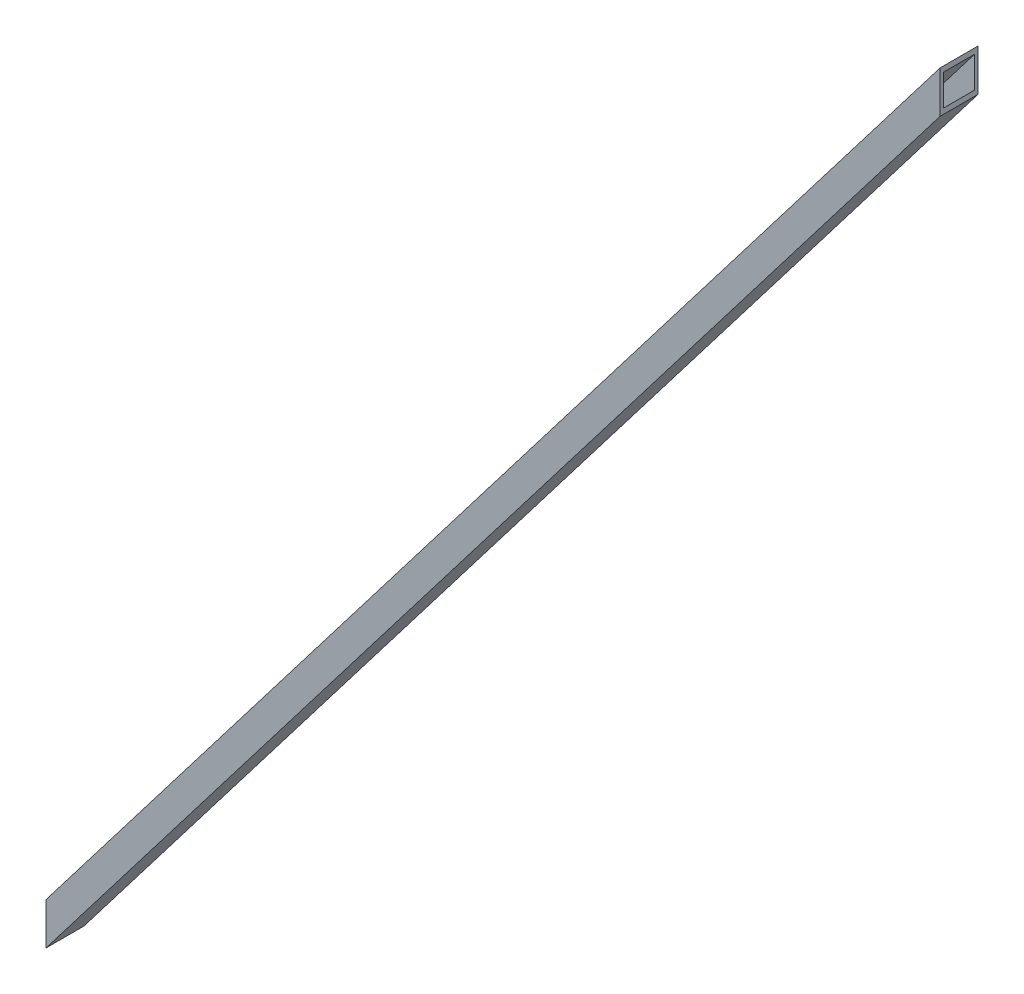
ISO-10303-21;
HEADER;
FILE_DESCRIPTION(('STEP AP214'),'2;1');
FILE_NAME('part.step','',(''),(''),'','','');
FILE_SCHEMA(('AUTOMOTIVE_DESIGN { 1 0 10303 214 1 1 1 1 }'));
ENDSEC;
DATA;
#1=APPLICATION_CONTEXT('core data for automotive mechanical design processes');
#2=APPLICATION_PROTOCOL_DEFINITION('international standard','automotive_design',2000,#1);
#3=PRODUCT_CONTEXT('',#1,'mechanical');
#4=PRODUCT('Part','Part','',(#3));
#5=PRODUCT_RELATED_PRODUCT_CATEGORY('part','',(#4));
#6=PRODUCT_DEFINITION_FORMATION('','',#4);
#7=PRODUCT_DEFINITION_CONTEXT('part definition',#1,'design');
#8=PRODUCT_DEFINITION('design','',#6,#7);
#9=PRODUCT_DEFINITION_SHAPE('','',#8);
#10=(LENGTH_UNIT() NAMED_UNIT(*) SI_UNIT(.MILLI.,.METRE.));
#11=(NAMED_UNIT(*) PLANE_ANGLE_UNIT() SI_UNIT($,.RADIAN.));
#12=(NAMED_UNIT(*) SI_UNIT($,.STERADIAN.) SOLID_ANGLE_UNIT());
#13=UNCERTAINTY_MEASURE_WITH_UNIT(LENGTH_MEASURE(1.E-05),#10,'distance_accuracy_value','');
#14=(GEOMETRIC_REPRESENTATION_CONTEXT(3) GLOBAL_UNCERTAINTY_ASSIGNED_CONTEXT((#13)) GLOBAL_UNIT_ASSIGNED_CONTEXT((#10,
#11,#12)) REPRESENTATION_CONTEXT('',''));
#15=CARTESIAN_POINT('',(0.,0.,0.));
#16=DIRECTION('',(0.,0.,1.));
#17=DIRECTION('',(1.,0.,0.));
#18=AXIS2_PLACEMENT_3D('',#15,#16,#17);
#19=CARTESIAN_POINT('',(-502.053424914183,28.9259895237384,-27.5));
#20=DIRECTION('',(-0.821369965673296,0.570395809495344,0.));
#21=DIRECTION('',(0.,0.,1.));
#22=AXIS2_PLACEMENT_3D('',#19,#20,#21);
#23=PLANE('',#22);
#24=DIRECTION('',(0.,0.,1.));
#25=VECTOR('',#24,1.);
#26=CARTESIAN_POINT('',(-500.,31.8829214001622,0.));
#27=LINE('',#26,#25);
#28=CARTESIAN_POINT('',(-500.,31.8829214001622,-30.2313000567496));
#29=VERTEX_POINT('',#28);
#30=CARTESIAN_POINT('',(-500.,31.8829214001622,0.231300056749522));
#31=VERTEX_POINT('',#30);
#32=EDGE_CURVE('E12',#29,#31,#27,.T.);
#33=ORIENTED_EDGE('',*,*,#32,.T.);
#34=DIRECTION('',(0.55323817471572,0.796662971590637,-0.243424796874917));
#35=VECTOR('',#34,1.);
#36=CARTESIAN_POINT('',(-498.197121324456,34.4790666929451,-0.561966560489669));
#37=LINE('',#36,#35);
#38=CARTESIAN_POINT('',(0.,751.882921400162,-219.768699943251));
#39=VERTEX_POINT('',#38);
#40=EDGE_CURVE('E96',#31,#39,#37,.T.);
#41=ORIENTED_EDGE('',*,*,#40,.T.);
#42=DIRECTION('',(0.,0.,1.));
#43=VECTOR('',#42,1.);
#44=CARTESIAN_POINT('',(0.,751.882921400162,0.));
#45=LINE('',#44,#43);
#46=CARTESIAN_POINT('',(0.,751.882921400162,-250.23130005675));
#47=VERTEX_POINT('',#46);
#48=EDGE_CURVE('E189',#47,#39,#45,.T.);
#49=ORIENTED_EDGE('',*,*,#48,.F.);
#50=DIRECTION('',(0.55323817471572,0.796662971590637,-0.243424796874917));
#51=VECTOR('',#50,1.);
#52=CARTESIAN_POINT('',(-513.318186471965,12.7047328805329,-24.371298009085));
#53=LINE('',#52,#51);
#54=EDGE_CURVE('E185',#29,#47,#53,.T.);
#55=ORIENTED_EDGE('',*,*,#54,.F.);
#56=EDGE_LOOP('',(#33,#41,#49,#55));
#57=FACE_BOUND('',#56,.T.);
#58=ADVANCED_FACE('F87',(#57),#23,.T.);
#59=CARTESIAN_POINT('',(-498.993153464335,27.5,-0.211712418943086));
#60=DIRECTION('',(0.402738614266017,0.,0.915315032422766));
#61=DIRECTION('',(0.,-1.,0.));
#62=AXIS2_PLACEMENT_3D('',#59,#60,#61);
#63=PLANE('',#62);
#64=DIRECTION('',(0.,-1.,0.));
#65=VECTOR('',#64,1.);
#66=CARTESIAN_POINT('',(-500.,0.,0.231300056749522));
#67=LINE('',#66,#65);
#68=CARTESIAN_POINT('',(-500.,-1.88292140016225,0.231300056749522));
#69=VERTEX_POINT('',#68);
#70=EDGE_CURVE('E184',#31,#69,#67,.T.);
#71=ORIENTED_EDGE('',*,*,#70,.T.);
#72=DIRECTION('',(0.55323817471572,0.796662971590637,-0.243424796874917));
#73=VECTOR('',#72,1.);
#74=CARTESIAN_POINT('',(-486.681813528035,17.2952671194671,-5.62870199091499));
#75=LINE('',#74,#73);
#76=CARTESIAN_POINT('',(0.,718.117078599838,-219.768699943251));
#77=VERTEX_POINT('',#76);
#78=EDGE_CURVE('E190',#69,#77,#75,.T.);
#79=ORIENTED_EDGE('',*,*,#78,.T.);
#80=DIRECTION('',(0.,-1.,0.));
#81=VECTOR('',#80,1.);
#82=CARTESIAN_POINT('',(0.,0.,-219.768699943251));
#83=LINE('',#82,#81);
#84=EDGE_CURVE('E204',#39,#77,#83,.T.);
#85=ORIENTED_EDGE('',*,*,#84,.F.);
#86=ORIENTED_EDGE('',*,*,#40,.F.);
#87=EDGE_LOOP('',(#71,#79,#85,#86));
#88=FACE_BOUND('',#87,.T.);
#89=ADVANCED_FACE('F218',(#88),#63,.T.);
#90=CARTESIAN_POINT('',(-497.946575085817,1.07401047626164,-2.5));
#91=DIRECTION('',(0.821369965673296,-0.570395809495344,0.));
#92=DIRECTION('',(0.,0.,-1.));
#93=AXIS2_PLACEMENT_3D('',#90,#91,#92);
#94=PLANE('',#93);
#95=DIRECTION('',(0.,0.,-1.));
#96=VECTOR('',#95,1.);
#97=CARTESIAN_POINT('',(-500.,-1.88292140016225,0.));
#98=LINE('',#97,#96);
#99=CARTESIAN_POINT('',(-500.,-1.88292140016225,-30.2313000567496));
#100=VERTEX_POINT('',#99);
#101=EDGE_CURVE('E193',#69,#100,#98,.T.);
#102=ORIENTED_EDGE('',*,*,#101,.T.);
#103=DIRECTION('',(0.55323817471572,0.796662971590637,-0.243424796874917));
#104=VECTOR('',#103,1.);
#105=CARTESIAN_POINT('',(-501.802878675544,-4.47906669294508,-29.4380334395104));
#106=LINE('',#105,#104);
#107=CARTESIAN_POINT('',(0.,718.117078599838,-250.23130005675));
#108=VERTEX_POINT('',#107);
#109=EDGE_CURVE('E194',#100,#108,#106,.T.);
#110=ORIENTED_EDGE('',*,*,#109,.T.);
#111=DIRECTION('',(0.,0.,-1.));
#112=VECTOR('',#111,1.);
#113=CARTESIAN_POINT('',(0.,718.117078599838,0.));
#114=LINE('',#113,#112);
#115=EDGE_CURVE('E206',#77,#108,#114,.T.);
#116=ORIENTED_EDGE('',*,*,#115,.F.);
#117=ORIENTED_EDGE('',*,*,#78,.F.);
#118=EDGE_LOOP('',(#102,#110,#116,#117));
#119=FACE_BOUND('',#118,.T.);
#120=ADVANCED_FACE('F221',(#119),#94,.T.);
#121=CARTESIAN_POINT('',(-501.006846535665,2.5,-29.7882875810569));
#122=DIRECTION('',(-0.402738614266017,0.,-0.915315032422766));
#123=DIRECTION('',(0.,1.,0.));
#124=AXIS2_PLACEMENT_3D('',#121,#122,#123);
#125=PLANE('',#124);
#126=DIRECTION('',(0.,1.,0.));
#127=VECTOR('',#126,1.);
#128=CARTESIAN_POINT('',(-500.,0.,-30.2313000567496));
#129=LINE('',#128,#127);
#130=EDGE_CURVE('E188',#100,#29,#129,.T.);
#131=ORIENTED_EDGE('',*,*,#130,.T.);
#132=ORIENTED_EDGE('',*,*,#54,.T.);
#133=DIRECTION('',(0.,1.,0.));
#134=VECTOR('',#133,1.);
#135=CARTESIAN_POINT('',(0.,0.,-250.23130005675));
#136=LINE('',#135,#134);
#137=EDGE_CURVE('E91',#108,#47,#136,.T.);
#138=ORIENTED_EDGE('',*,*,#137,.F.);
#139=ORIENTED_EDGE('',*,*,#109,.F.);
#140=EDGE_LOOP('',(#131,#132,#138,#139));
#141=FACE_BOUND('',#140,.T.);
#142=ADVANCED_FACE('F89',(#141),#125,.T.);
#143=CARTESIAN_POINT('',(-500.,0.,0.));
#144=DIRECTION('',(1.,0.,0.));
#145=DIRECTION('',(0.,0.,-1.));
#146=AXIS2_PLACEMENT_3D('',#143,#144,#145);
#147=PLANE('',#146);
#148=DIRECTION('',(0.,0.,-1.));
#149=VECTOR('',#148,1.);
#150=CARTESIAN_POINT('',(-500.,2.5,-15.));
#151=LINE('',#150,#149);
#152=CARTESIAN_POINT('',(-500.,2.5,-2.5));
#153=VERTEX_POINT('',#152);
#154=CARTESIAN_POINT('',(-500.,2.5,-27.5));
#155=VERTEX_POINT('',#154);
#156=EDGE_CURVE('E171',#153,#155,#151,.T.);
#157=ORIENTED_EDGE('',*,*,#156,.T.);
#158=DIRECTION('',(0.,1.,0.));
#159=VECTOR('',#158,1.);
#160=CARTESIAN_POINT('',(-500.,15.,-27.5));
#161=LINE('',#160,#159);
#162=CARTESIAN_POINT('',(-500.,27.5,-27.5));
#163=VERTEX_POINT('',#162);
#164=EDGE_CURVE('E163',#155,#163,#161,.T.);
#165=ORIENTED_EDGE('',*,*,#164,.T.);
#166=DIRECTION('',(0.,0.,1.));
#167=VECTOR('',#166,1.);
#168=CARTESIAN_POINT('',(-500.,27.5,-15.));
#169=LINE('',#168,#167);
#170=CARTESIAN_POINT('',(-500.,27.5,-2.5));
#171=VERTEX_POINT('',#170);
#172=EDGE_CURVE('E153',#163,#171,#169,.T.);
#173=ORIENTED_EDGE('',*,*,#172,.T.);
#174=DIRECTION('',(0.,-1.,0.));
#175=VECTOR('',#174,1.);
#176=CARTESIAN_POINT('',(-500.,15.,-2.5));
#177=LINE('',#176,#175);
#178=EDGE_CURVE('E336',#171,#153,#177,.T.);
#179=ORIENTED_EDGE('',*,*,#178,.T.);
#180=EDGE_LOOP('',(#157,#165,#173,#179));
#181=FACE_BOUND('',#180,.T.);
#182=ORIENTED_EDGE('',*,*,#130,.F.);
#183=ORIENTED_EDGE('',*,*,#101,.F.);
#184=ORIENTED_EDGE('',*,*,#70,.F.);
#185=ORIENTED_EDGE('',*,*,#32,.F.);
#186=EDGE_LOOP('',(#182,#183,#184,#185));
#187=FACE_BOUND('',#186,.T.);
#188=ADVANCED_FACE('F169',(#181,#187),#147,.F.);
#189=CARTESIAN_POINT('',(0.,0.,0.));
#190=DIRECTION('',(1.,0.,0.));
#191=DIRECTION('',(0.,0.,-1.));
#192=AXIS2_PLACEMENT_3D('',#189,#190,#191);
#193=PLANE('',#192);
#194=DIRECTION('',(0.,0.,1.));
#195=VECTOR('',#194,1.);
#196=CARTESIAN_POINT('',(0.,747.5,-235.));
#197=LINE('',#196,#195);
#198=CARTESIAN_POINT('',(0.,747.5,-247.5));
#199=VERTEX_POINT('',#198);
#200=CARTESIAN_POINT('',(0.,747.5,-222.5));
#201=VERTEX_POINT('',#200);
#202=EDGE_CURVE('E166',#199,#201,#197,.T.);
#203=ORIENTED_EDGE('',*,*,#202,.F.);
#204=DIRECTION('',(0.,1.,0.));
#205=VECTOR('',#204,1.);
#206=CARTESIAN_POINT('',(0.,735.,-247.5));
#207=LINE('',#206,#205);
#208=CARTESIAN_POINT('',(0.,722.5,-247.5));
#209=VERTEX_POINT('',#208);
#210=EDGE_CURVE('E165',#209,#199,#207,.T.);
#211=ORIENTED_EDGE('',*,*,#210,.F.);
#212=DIRECTION('',(0.,0.,-1.));
#213=VECTOR('',#212,1.);
#214=CARTESIAN_POINT('',(0.,722.5,-235.));
#215=LINE('',#214,#213);
#216=CARTESIAN_POINT('',(0.,722.5,-222.5));
#217=VERTEX_POINT('',#216);
#218=EDGE_CURVE('E179',#217,#209,#215,.T.);
#219=ORIENTED_EDGE('',*,*,#218,.F.);
#220=DIRECTION('',(0.,-1.,0.));
#221=VECTOR('',#220,1.);
#222=CARTESIAN_POINT('',(0.,735.,-222.5));
#223=LINE('',#222,#221);
#224=EDGE_CURVE('E177',#201,#217,#223,.T.);
#225=ORIENTED_EDGE('',*,*,#224,.F.);
#226=EDGE_LOOP('',(#203,#211,#219,#225));
#227=FACE_BOUND('',#226,.T.);
#228=ORIENTED_EDGE('',*,*,#48,.T.);
#229=ORIENTED_EDGE('',*,*,#84,.T.);
#230=ORIENTED_EDGE('',*,*,#115,.T.);
#231=ORIENTED_EDGE('',*,*,#137,.T.);
#232=EDGE_LOOP('',(#228,#229,#230,#231));
#233=FACE_BOUND('',#232,.T.);
#234=ADVANCED_FACE('F210',(#227,#233),#193,.T.);
#235=CARTESIAN_POINT('',(-500.,27.5,-27.5));
#236=DIRECTION('',(-0.821369965673296,0.570395809495344,0.));
#237=DIRECTION('',(0.,0.,1.));
#238=AXIS2_PLACEMENT_3D('',#235,#236,#237);
#239=PLANE('',#238);
#240=ORIENTED_EDGE('',*,*,#172,.F.);
#241=DIRECTION('',(0.55323817471572,0.796662971590637,-0.243424796874917));
#242=VECTOR('',#241,1.);
#243=CARTESIAN_POINT('',(-250.,387.5,-137.5));
#244=LINE('',#243,#242);
#245=EDGE_CURVE('E156',#163,#199,#244,.T.);
#246=ORIENTED_EDGE('',*,*,#245,.T.);
#247=ORIENTED_EDGE('',*,*,#202,.T.);
#248=DIRECTION('',(0.55323817471572,0.796662971590637,-0.243424796874917));
#249=VECTOR('',#248,1.);
#250=CARTESIAN_POINT('',(-250.,387.5,-112.5));
#251=LINE('',#250,#249);
#252=EDGE_CURVE('E104',#171,#201,#251,.T.);
#253=ORIENTED_EDGE('',*,*,#252,.F.);
#254=EDGE_LOOP('',(#240,#246,#247,#253));
#255=FACE_BOUND('',#254,.T.);
#256=ADVANCED_FACE('F155',(#255),#239,.F.);
#257=CARTESIAN_POINT('',(-500.,27.5,-2.5));
#258=DIRECTION('',(0.402738614266017,0.,0.915315032422766));
#259=DIRECTION('',(0.,-1.,0.));
#260=AXIS2_PLACEMENT_3D('',#257,#258,#259);
#261=PLANE('',#260);
#262=ORIENTED_EDGE('',*,*,#178,.F.);
#263=ORIENTED_EDGE('',*,*,#252,.T.);
#264=ORIENTED_EDGE('',*,*,#224,.T.);
#265=DIRECTION('',(0.55323817471572,0.796662971590637,-0.243424796874917));
#266=VECTOR('',#265,1.);
#267=CARTESIAN_POINT('',(-250.,362.5,-112.5));
#268=LINE('',#267,#266);
#269=EDGE_CURVE('E339',#153,#217,#268,.T.);
#270=ORIENTED_EDGE('',*,*,#269,.F.);
#271=EDGE_LOOP('',(#262,#263,#264,#270));
#272=FACE_BOUND('',#271,.T.);
#273=ADVANCED_FACE('F243',(#272),#261,.F.);
#274=CARTESIAN_POINT('',(-500.,2.5,-2.5));
#275=DIRECTION('',(0.821369965673296,-0.570395809495344,0.));
#276=DIRECTION('',(0.,0.,-1.));
#277=AXIS2_PLACEMENT_3D('',#274,#275,#276);
#278=PLANE('',#277);
#279=ORIENTED_EDGE('',*,*,#156,.F.);
#280=ORIENTED_EDGE('',*,*,#269,.T.);
#281=ORIENTED_EDGE('',*,*,#218,.T.);
#282=DIRECTION('',(0.55323817471572,0.796662971590637,-0.243424796874917));
#283=VECTOR('',#282,1.);
#284=CARTESIAN_POINT('',(-250.,362.5,-137.5));
#285=LINE('',#284,#283);
#286=EDGE_CURVE('E112',#155,#209,#285,.T.);
#287=ORIENTED_EDGE('',*,*,#286,.F.);
#288=EDGE_LOOP('',(#279,#280,#281,#287));
#289=FACE_BOUND('',#288,.T.);
#290=ADVANCED_FACE('F240',(#289),#278,.F.);
#291=CARTESIAN_POINT('',(-500.,2.5,-27.5));
#292=DIRECTION('',(-0.402738614266017,0.,-0.915315032422766));
#293=DIRECTION('',(0.,1.,0.));
#294=AXIS2_PLACEMENT_3D('',#291,#292,#293);
#295=PLANE('',#294);
#296=ORIENTED_EDGE('',*,*,#164,.F.);
#297=ORIENTED_EDGE('',*,*,#286,.T.);
#298=ORIENTED_EDGE('',*,*,#210,.T.);
#299=ORIENTED_EDGE('',*,*,#245,.F.);
#300=EDGE_LOOP('',(#296,#297,#298,#299));
#301=FACE_BOUND('',#300,.T.);
#302=ADVANCED_FACE('F162',(#301),#295,.F.);
#303=CLOSED_SHELL('',(#58,#89,#120,#142,#188,#234,#256,#273,#290,#302));
#304=MANIFOLD_SOLID_BREP('B2',#303);
#305=ADVANCED_BREP_SHAPE_REPRESENTATION('',(#18,#304),#14);
#306=SHAPE_DEFINITION_REPRESENTATION(#9,#305);
ENDSEC;
END-ISO-10303-21;
